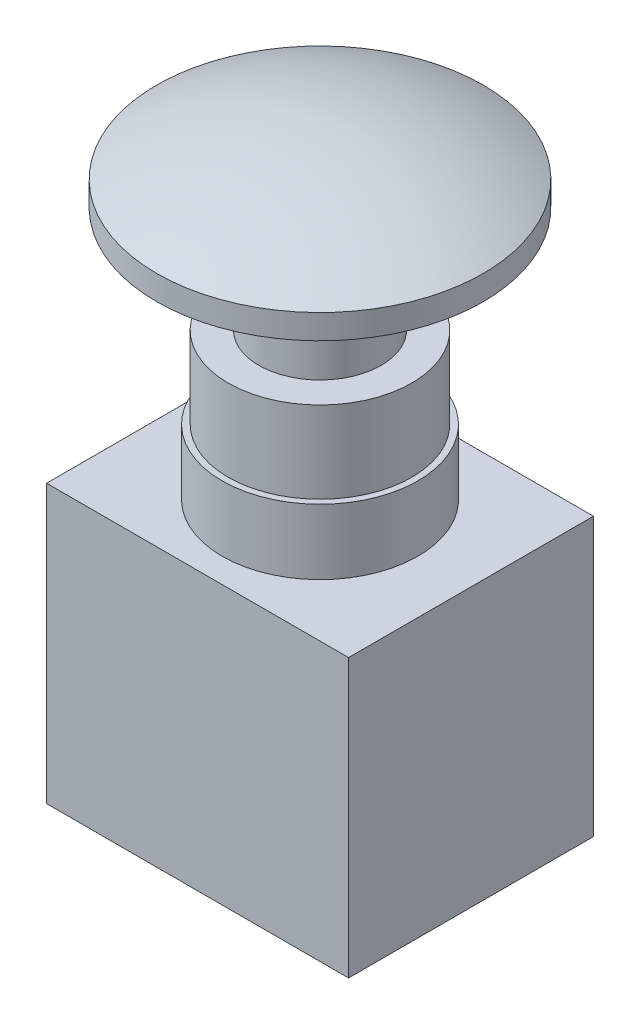
ISO-10303-21;
HEADER;
FILE_DESCRIPTION(('STEP AP214'),'2;1');
FILE_NAME('part.step','',(''),(''),'','','');
FILE_SCHEMA(('AUTOMOTIVE_DESIGN { 1 0 10303 214 1 1 1 1 }'));
ENDSEC;
DATA;
#1=APPLICATION_CONTEXT('core data for automotive mechanical design processes');
#2=APPLICATION_PROTOCOL_DEFINITION('international standard','automotive_design',2000,#1);
#3=PRODUCT_CONTEXT('',#1,'mechanical');
#4=PRODUCT('Part','Part','',(#3));
#5=PRODUCT_RELATED_PRODUCT_CATEGORY('part','',(#4));
#6=PRODUCT_DEFINITION_FORMATION('','',#4);
#7=PRODUCT_DEFINITION_CONTEXT('part definition',#1,'design');
#8=PRODUCT_DEFINITION('design','',#6,#7);
#9=PRODUCT_DEFINITION_SHAPE('','',#8);
#10=(LENGTH_UNIT() NAMED_UNIT(*) SI_UNIT(.MILLI.,.METRE.));
#11=(NAMED_UNIT(*) PLANE_ANGLE_UNIT() SI_UNIT($,.RADIAN.));
#12=(NAMED_UNIT(*) SI_UNIT($,.STERADIAN.) SOLID_ANGLE_UNIT());
#13=UNCERTAINTY_MEASURE_WITH_UNIT(LENGTH_MEASURE(1.E-05),#10,'distance_accuracy_value','');
#14=(GEOMETRIC_REPRESENTATION_CONTEXT(3) GLOBAL_UNCERTAINTY_ASSIGNED_CONTEXT((#13)) GLOBAL_UNIT_ASSIGNED_CONTEXT((#10,
#11,#12)) REPRESENTATION_CONTEXT('',''));
#15=CARTESIAN_POINT('',(0.,0.,0.));
#16=DIRECTION('',(0.,0.,1.));
#17=DIRECTION('',(1.,0.,0.));
#18=AXIS2_PLACEMENT_3D('',#15,#16,#17);
#19=CARTESIAN_POINT('',(18.5,-34.,15.));
#20=DIRECTION('',(1.,0.,0.));
#21=DIRECTION('',(0.,0.,-1.));
#22=AXIS2_PLACEMENT_3D('',#19,#20,#21);
#23=PLANE('',#22);
#24=DIRECTION('',(0.,0.,-1.));
#25=VECTOR('',#24,1.);
#26=CARTESIAN_POINT('',(18.5,0.,15.));
#27=LINE('',#26,#25);
#28=CARTESIAN_POINT('',(18.5,0.,15.));
#29=VERTEX_POINT('',#28);
#30=CARTESIAN_POINT('',(18.5,0.,-15.));
#31=VERTEX_POINT('',#30);
#32=EDGE_CURVE('E104',#29,#31,#27,.T.);
#33=ORIENTED_EDGE('',*,*,#32,.F.);
#34=DIRECTION('',(0.,1.,0.));
#35=VECTOR('',#34,1.);
#36=CARTESIAN_POINT('',(18.5,-34.,15.));
#37=LINE('',#36,#35);
#38=CARTESIAN_POINT('',(18.5,-34.,15.));
#39=VERTEX_POINT('',#38);
#40=EDGE_CURVE('E54',#39,#29,#37,.T.);
#41=ORIENTED_EDGE('',*,*,#40,.F.);
#42=DIRECTION('',(0.,0.,-1.));
#43=VECTOR('',#42,1.);
#44=CARTESIAN_POINT('',(18.5,-34.,15.));
#45=LINE('',#44,#43);
#46=CARTESIAN_POINT('',(18.5,-34.,-15.));
#47=VERTEX_POINT('',#46);
#48=EDGE_CURVE('E97',#39,#47,#45,.T.);
#49=ORIENTED_EDGE('',*,*,#48,.T.);
#50=DIRECTION('',(0.,1.,0.));
#51=VECTOR('',#50,1.);
#52=CARTESIAN_POINT('',(18.5,-34.,-15.));
#53=LINE('',#52,#51);
#54=EDGE_CURVE('E39',#47,#31,#53,.T.);
#55=ORIENTED_EDGE('',*,*,#54,.T.);
#56=EDGE_LOOP('',(#33,#41,#49,#55));
#57=FACE_BOUND('',#56,.T.);
#58=ADVANCED_FACE('F36',(#57),#23,.T.);
#59=CARTESIAN_POINT('',(-18.5,-34.,15.));
#60=DIRECTION('',(0.,0.,1.));
#61=DIRECTION('',(1.,0.,0.));
#62=AXIS2_PLACEMENT_3D('',#59,#60,#61);
#63=PLANE('',#62);
#64=DIRECTION('',(1.,0.,0.));
#65=VECTOR('',#64,1.);
#66=CARTESIAN_POINT('',(-18.5,0.,15.));
#67=LINE('',#66,#65);
#68=CARTESIAN_POINT('',(-18.5,0.,15.));
#69=VERTEX_POINT('',#68);
#70=EDGE_CURVE('E99',#69,#29,#67,.T.);
#71=ORIENTED_EDGE('',*,*,#70,.F.);
#72=DIRECTION('',(0.,1.,0.));
#73=VECTOR('',#72,1.);
#74=CARTESIAN_POINT('',(-18.5,-34.,15.));
#75=LINE('',#74,#73);
#76=CARTESIAN_POINT('',(-18.5,-34.,15.));
#77=VERTEX_POINT('',#76);
#78=EDGE_CURVE('E71',#77,#69,#75,.T.);
#79=ORIENTED_EDGE('',*,*,#78,.F.);
#80=DIRECTION('',(1.,0.,0.));
#81=VECTOR('',#80,1.);
#82=CARTESIAN_POINT('',(-18.5,-34.,15.));
#83=LINE('',#82,#81);
#84=EDGE_CURVE('E94',#77,#39,#83,.T.);
#85=ORIENTED_EDGE('',*,*,#84,.T.);
#86=ORIENTED_EDGE('',*,*,#40,.T.);
#87=EDGE_LOOP('',(#71,#79,#85,#86));
#88=FACE_BOUND('',#87,.T.);
#89=ADVANCED_FACE('F157',(#88),#63,.T.);
#90=CARTESIAN_POINT('',(-18.5,-34.,15.));
#91=DIRECTION('',(-1.,0.,0.));
#92=DIRECTION('',(0.,0.,1.));
#93=AXIS2_PLACEMENT_3D('',#90,#91,#92);
#94=PLANE('',#93);
#95=DIRECTION('',(0.,0.,1.));
#96=VECTOR('',#95,1.);
#97=CARTESIAN_POINT('',(-18.5,0.,15.));
#98=LINE('',#97,#96);
#99=CARTESIAN_POINT('',(-18.5,0.,-15.));
#100=VERTEX_POINT('',#99);
#101=EDGE_CURVE('E89',#100,#69,#98,.T.);
#102=ORIENTED_EDGE('',*,*,#101,.F.);
#103=DIRECTION('',(0.,1.,0.));
#104=VECTOR('',#103,1.);
#105=CARTESIAN_POINT('',(-18.5,-34.,-15.));
#106=LINE('',#105,#104);
#107=CARTESIAN_POINT('',(-18.5,-34.,-15.));
#108=VERTEX_POINT('',#107);
#109=EDGE_CURVE('E84',#108,#100,#106,.T.);
#110=ORIENTED_EDGE('',*,*,#109,.F.);
#111=DIRECTION('',(0.,0.,1.));
#112=VECTOR('',#111,1.);
#113=CARTESIAN_POINT('',(-18.5,-34.,15.));
#114=LINE('',#113,#112);
#115=EDGE_CURVE('E87',#108,#77,#114,.T.);
#116=ORIENTED_EDGE('',*,*,#115,.T.);
#117=ORIENTED_EDGE('',*,*,#78,.T.);
#118=EDGE_LOOP('',(#102,#110,#116,#117));
#119=FACE_BOUND('',#118,.T.);
#120=ADVANCED_FACE('F86',(#119),#94,.T.);
#121=CARTESIAN_POINT('',(-18.5,-34.,-15.));
#122=DIRECTION('',(0.,0.,-1.));
#123=DIRECTION('',(-1.,0.,0.));
#124=AXIS2_PLACEMENT_3D('',#121,#122,#123);
#125=PLANE('',#124);
#126=DIRECTION('',(-1.,0.,0.));
#127=VECTOR('',#126,1.);
#128=CARTESIAN_POINT('',(-18.5,0.,-15.));
#129=LINE('',#128,#127);
#130=EDGE_CURVE('E107',#31,#100,#129,.T.);
#131=ORIENTED_EDGE('',*,*,#130,.F.);
#132=ORIENTED_EDGE('',*,*,#54,.F.);
#133=DIRECTION('',(-1.,0.,0.));
#134=VECTOR('',#133,1.);
#135=CARTESIAN_POINT('',(-18.5,-34.,-15.));
#136=LINE('',#135,#134);
#137=EDGE_CURVE('E93',#47,#108,#136,.T.);
#138=ORIENTED_EDGE('',*,*,#137,.T.);
#139=ORIENTED_EDGE('',*,*,#109,.T.);
#140=EDGE_LOOP('',(#131,#132,#138,#139));
#141=FACE_BOUND('',#140,.T.);
#142=ADVANCED_FACE('F96',(#141),#125,.T.);
#143=CARTESIAN_POINT('',(0.,-34.,0.));
#144=DIRECTION('',(0.,-1.,0.));
#145=DIRECTION('',(0.,0.,-1.));
#146=AXIS2_PLACEMENT_3D('',#143,#144,#145);
#147=PLANE('',#146);
#148=ORIENTED_EDGE('',*,*,#48,.F.);
#149=ORIENTED_EDGE('',*,*,#84,.F.);
#150=ORIENTED_EDGE('',*,*,#115,.F.);
#151=ORIENTED_EDGE('',*,*,#137,.F.);
#152=EDGE_LOOP('',(#148,#149,#150,#151));
#153=FACE_BOUND('',#152,.T.);
#154=ADVANCED_FACE('F92',(#153),#147,.T.);
#155=CARTESIAN_POINT('',(0.,0.,0.));
#156=DIRECTION('',(0.,-1.,0.));
#157=DIRECTION('',(0.,0.,-1.));
#158=AXIS2_PLACEMENT_3D('',#155,#156,#157);
#159=PLANE('',#158);
#160=CARTESIAN_POINT('',(0.,0.,0.));
#161=DIRECTION('',(0.,1.,0.));
#162=DIRECTION('',(0.,0.,1.));
#163=AXIS2_PLACEMENT_3D('',#160,#161,#162);
#164=CIRCLE('',#163,12.);
#165=CARTESIAN_POINT('',(0.,0.,12.));
#166=VERTEX_POINT('',#165);
#167=EDGE_CURVE('E45',#166,#166,#164,.T.);
#168=ORIENTED_EDGE('',*,*,#167,.F.);
#169=EDGE_LOOP('',(#168));
#170=FACE_BOUND('',#169,.T.);
#171=ORIENTED_EDGE('',*,*,#32,.T.);
#172=ORIENTED_EDGE('',*,*,#130,.T.);
#173=ORIENTED_EDGE('',*,*,#101,.T.);
#174=ORIENTED_EDGE('',*,*,#70,.T.);
#175=EDGE_LOOP('',(#171,#172,#173,#174));
#176=FACE_BOUND('',#175,.T.);
#177=ADVANCED_FACE('F163',(#170,#176),#159,.F.);
#178=CARTESIAN_POINT('',(0.,8.,0.));
#179=DIRECTION('',(0.,-1.,0.));
#180=DIRECTION('',(0.,0.,-1.));
#181=AXIS2_PLACEMENT_3D('',#178,#179,#180);
#182=CYLINDRICAL_SURFACE('',#181,12.);
#183=CARTESIAN_POINT('',(0.,8.,0.));
#184=DIRECTION('',(0.,1.,0.));
#185=DIRECTION('',(0.,0.,1.));
#186=AXIS2_PLACEMENT_3D('',#183,#184,#185);
#187=CIRCLE('',#186,12.);
#188=CARTESIAN_POINT('',(0.,8.,12.));
#189=VERTEX_POINT('',#188);
#190=EDGE_CURVE('E108',#189,#189,#187,.T.);
#191=ORIENTED_EDGE('',*,*,#190,.F.);
#192=EDGE_LOOP('',(#191));
#193=FACE_BOUND('',#192,.T.);
#194=ORIENTED_EDGE('',*,*,#167,.T.);
#195=EDGE_LOOP('',(#194));
#196=FACE_BOUND('',#195,.T.);
#197=ADVANCED_FACE('F165',(#193,#196),#182,.T.);
#198=CARTESIAN_POINT('',(0.,8.,0.));
#199=DIRECTION('',(0.,1.,0.));
#200=DIRECTION('',(0.,0.,1.));
#201=AXIS2_PLACEMENT_3D('',#198,#199,#200);
#202=PLANE('',#201);
#203=CARTESIAN_POINT('',(0.,8.,0.));
#204=DIRECTION('',(0.,1.,0.));
#205=DIRECTION('',(0.,0.,1.));
#206=AXIS2_PLACEMENT_3D('',#203,#204,#205);
#207=CIRCLE('',#206,11.25);
#208=CARTESIAN_POINT('',(0.,8.,11.25));
#209=VERTEX_POINT('',#208);
#210=EDGE_CURVE('E11',#209,#209,#207,.T.);
#211=ORIENTED_EDGE('',*,*,#210,.F.);
#212=EDGE_LOOP('',(#211));
#213=FACE_BOUND('',#212,.T.);
#214=ORIENTED_EDGE('',*,*,#190,.T.);
#215=EDGE_LOOP('',(#214));
#216=FACE_BOUND('',#215,.T.);
#217=ADVANCED_FACE('F172',(#213,#216),#202,.T.);
#218=CARTESIAN_POINT('',(0.,18.,0.));
#219=DIRECTION('',(0.,-1.,0.));
#220=DIRECTION('',(0.,0.,-1.));
#221=AXIS2_PLACEMENT_3D('',#218,#219,#220);
#222=CYLINDRICAL_SURFACE('',#221,11.25);
#223=CARTESIAN_POINT('',(0.,18.,0.));
#224=DIRECTION('',(0.,1.,0.));
#225=DIRECTION('',(0.,0.,1.));
#226=AXIS2_PLACEMENT_3D('',#223,#224,#225);
#227=CIRCLE('',#226,11.25);
#228=CARTESIAN_POINT('',(0.,18.,11.25));
#229=VERTEX_POINT('',#228);
#230=EDGE_CURVE('E119',#229,#229,#227,.T.);
#231=ORIENTED_EDGE('',*,*,#230,.F.);
#232=EDGE_LOOP('',(#231));
#233=FACE_BOUND('',#232,.T.);
#234=ORIENTED_EDGE('',*,*,#210,.T.);
#235=EDGE_LOOP('',(#234));
#236=FACE_BOUND('',#235,.T.);
#237=ADVANCED_FACE('F206',(#233,#236),#222,.T.);
#238=CARTESIAN_POINT('',(0.,18.,0.));
#239=DIRECTION('',(0.,1.,0.));
#240=DIRECTION('',(0.,0.,1.));
#241=AXIS2_PLACEMENT_3D('',#238,#239,#240);
#242=PLANE('',#241);
#243=CARTESIAN_POINT('',(0.,18.,0.));
#244=DIRECTION('',(0.,-1.,0.));
#245=DIRECTION('',(0.,0.,-1.));
#246=AXIS2_PLACEMENT_3D('',#243,#244,#245);
#247=CIRCLE('',#246,7.5);
#248=CARTESIAN_POINT('',(0.,18.,-7.5));
#249=VERTEX_POINT('',#248);
#250=EDGE_CURVE('E138',#249,#249,#247,.T.);
#251=ORIENTED_EDGE('',*,*,#250,.T.);
#252=EDGE_LOOP('',(#251));
#253=FACE_BOUND('',#252,.T.);
#254=ORIENTED_EDGE('',*,*,#230,.T.);
#255=EDGE_LOOP('',(#254));
#256=FACE_BOUND('',#255,.T.);
#257=ADVANCED_FACE('F142',(#253,#256),#242,.T.);
#258=CARTESIAN_POINT('',(0.,-3.50000000000012,0.));
#259=DIRECTION('',(0.,-1.,0.));
#260=DIRECTION('',(0.,0.,-1.));
#261=AXIS2_PLACEMENT_3D('',#258,#259,#260);
#262=SPHERICAL_SURFACE('',#261,42.5000000000001);
#263=CARTESIAN_POINT('',(0.,34.,0.));
#264=DIRECTION('',(0.,-1.,0.));
#265=DIRECTION('',(0.,0.,-1.));
#266=AXIS2_PLACEMENT_3D('',#263,#264,#265);
#267=CIRCLE('',#266,20.);
#268=CARTESIAN_POINT('',(0.,34.,-20.));
#269=VERTEX_POINT('',#268);
#270=EDGE_CURVE('E123',#269,#269,#267,.T.);
#271=ORIENTED_EDGE('',*,*,#270,.F.);
#272=EDGE_LOOP('',(#271));
#273=FACE_BOUND('',#272,.T.);
#274=ADVANCED_FACE('F225',(#273),#262,.T.);
#275=CARTESIAN_POINT('',(0.,-965.379937914091,0.));
#276=DIRECTION('',(0.,-1.,0.));
#277=DIRECTION('',(0.,0.,-1.));
#278=AXIS2_PLACEMENT_3D('',#275,#276,#277);
#279=CYLINDRICAL_SURFACE('',#278,20.);
#280=ORIENTED_EDGE('',*,*,#270,.T.);
#281=EDGE_LOOP('',(#280));
#282=FACE_BOUND('',#281,.T.);
#283=CARTESIAN_POINT('',(0.,31.,0.));
#284=DIRECTION('',(0.,-1.,0.));
#285=DIRECTION('',(0.,0.,-1.));
#286=AXIS2_PLACEMENT_3D('',#283,#284,#285);
#287=CIRCLE('',#286,20.);
#288=CARTESIAN_POINT('',(0.,31.,-20.));
#289=VERTEX_POINT('',#288);
#290=EDGE_CURVE('E126',#289,#289,#287,.T.);
#291=ORIENTED_EDGE('',*,*,#290,.F.);
#292=EDGE_LOOP('',(#291));
#293=FACE_BOUND('',#292,.T.);
#294=ADVANCED_FACE('F234',(#282,#293),#279,.T.);
#295=CARTESIAN_POINT('',(0.,31.,-11.5));
#296=DIRECTION('',(0.,-1.,0.));
#297=DIRECTION('',(0.,0.,-1.));
#298=AXIS2_PLACEMENT_3D('',#295,#296,#297);
#299=PLANE('',#298);
#300=ORIENTED_EDGE('',*,*,#290,.T.);
#301=EDGE_LOOP('',(#300));
#302=FACE_BOUND('',#301,.T.);
#303=CARTESIAN_POINT('',(0.,31.,0.));
#304=DIRECTION('',(0.,-1.,0.));
#305=DIRECTION('',(0.,0.,-1.));
#306=AXIS2_PLACEMENT_3D('',#303,#304,#305);
#307=CIRCLE('',#306,11.5);
#308=CARTESIAN_POINT('',(0.,31.,-11.5));
#309=VERTEX_POINT('',#308);
#310=EDGE_CURVE('E129',#309,#309,#307,.T.);
#311=ORIENTED_EDGE('',*,*,#310,.F.);
#312=EDGE_LOOP('',(#311));
#313=FACE_BOUND('',#312,.T.);
#314=ADVANCED_FACE('F244',(#302,#313),#299,.T.);
#315=CARTESIAN_POINT('',(0.,-965.379937914091,0.));
#316=DIRECTION('',(0.,-1.,0.));
#317=DIRECTION('',(0.,0.,-1.));
#318=AXIS2_PLACEMENT_3D('',#315,#316,#317);
#319=CYLINDRICAL_SURFACE('',#318,11.5);
#320=ORIENTED_EDGE('',*,*,#310,.T.);
#321=EDGE_LOOP('',(#320));
#322=FACE_BOUND('',#321,.T.);
#323=CARTESIAN_POINT('',(0.,26.,0.));
#324=DIRECTION('',(0.,-1.,0.));
#325=DIRECTION('',(0.,0.,-1.));
#326=AXIS2_PLACEMENT_3D('',#323,#324,#325);
#327=CIRCLE('',#326,11.5);
#328=CARTESIAN_POINT('',(0.,26.,-11.5));
#329=VERTEX_POINT('',#328);
#330=EDGE_CURVE('E132',#329,#329,#327,.T.);
#331=ORIENTED_EDGE('',*,*,#330,.F.);
#332=EDGE_LOOP('',(#331));
#333=FACE_BOUND('',#332,.T.);
#334=ADVANCED_FACE('F153',(#322,#333),#319,.T.);
#335=CARTESIAN_POINT('',(0.,26.,-7.5));
#336=DIRECTION('',(0.,-1.,0.));
#337=DIRECTION('',(0.,0.,-1.));
#338=AXIS2_PLACEMENT_3D('',#335,#336,#337);
#339=PLANE('',#338);
#340=ORIENTED_EDGE('',*,*,#330,.T.);
#341=EDGE_LOOP('',(#340));
#342=FACE_BOUND('',#341,.T.);
#343=CARTESIAN_POINT('',(0.,26.,0.));
#344=DIRECTION('',(0.,-1.,0.));
#345=DIRECTION('',(0.,0.,-1.));
#346=AXIS2_PLACEMENT_3D('',#343,#344,#345);
#347=CIRCLE('',#346,7.5);
#348=CARTESIAN_POINT('',(0.,26.,-7.5));
#349=VERTEX_POINT('',#348);
#350=EDGE_CURVE('E135',#349,#349,#347,.T.);
#351=ORIENTED_EDGE('',*,*,#350,.F.);
#352=EDGE_LOOP('',(#351));
#353=FACE_BOUND('',#352,.T.);
#354=ADVANCED_FACE('F147',(#342,#353),#339,.T.);
#355=CARTESIAN_POINT('',(0.,-965.379937914091,0.));
#356=DIRECTION('',(0.,-1.,0.));
#357=DIRECTION('',(0.,0.,-1.));
#358=AXIS2_PLACEMENT_3D('',#355,#356,#357);
#359=CYLINDRICAL_SURFACE('',#358,7.5);
#360=ORIENTED_EDGE('',*,*,#350,.T.);
#361=EDGE_LOOP('',(#360));
#362=FACE_BOUND('',#361,.T.);
#363=ORIENTED_EDGE('',*,*,#250,.F.);
#364=EDGE_LOOP('',(#363));
#365=FACE_BOUND('',#364,.T.);
#366=ADVANCED_FACE('F145',(#362,#365),#359,.T.);
#367=CLOSED_SHELL('',(#58,#89,#120,#142,#154,#177,#197,#217,#237,#257,#274,#294,#314,#334,#354,#366));
#368=MANIFOLD_SOLID_BREP('B2',#367);
#369=ADVANCED_BREP_SHAPE_REPRESENTATION('',(#18,#368),#14);
#370=SHAPE_DEFINITION_REPRESENTATION(#9,#369);
ENDSEC;
END-ISO-10303-21;
